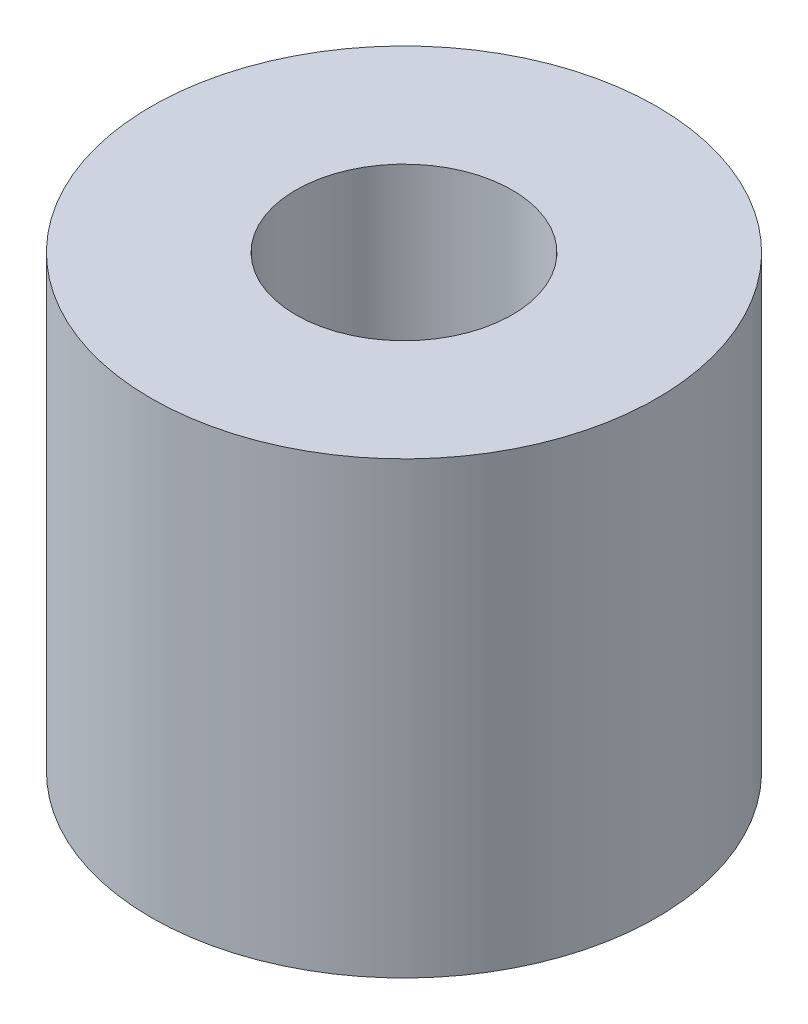
ISO-10303-21;
HEADER;
FILE_DESCRIPTION(('STEP AP214'),'2;1');
FILE_NAME('part.step','',(''),(''),'','','');
FILE_SCHEMA(('AUTOMOTIVE_DESIGN { 1 0 10303 214 1 1 1 1 }'));
ENDSEC;
DATA;
#1=APPLICATION_CONTEXT('core data for automotive mechanical design processes');
#2=APPLICATION_PROTOCOL_DEFINITION('international standard','automotive_design',2000,#1);
#3=PRODUCT_CONTEXT('',#1,'mechanical');
#4=PRODUCT('Part','Part','',(#3));
#5=PRODUCT_RELATED_PRODUCT_CATEGORY('part','',(#4));
#6=PRODUCT_DEFINITION_FORMATION('','',#4);
#7=PRODUCT_DEFINITION_CONTEXT('part definition',#1,'design');
#8=PRODUCT_DEFINITION('design','',#6,#7);
#9=PRODUCT_DEFINITION_SHAPE('','',#8);
#10=(LENGTH_UNIT() NAMED_UNIT(*) SI_UNIT(.MILLI.,.METRE.));
#11=(NAMED_UNIT(*) PLANE_ANGLE_UNIT() SI_UNIT($,.RADIAN.));
#12=(NAMED_UNIT(*) SI_UNIT($,.STERADIAN.) SOLID_ANGLE_UNIT());
#13=UNCERTAINTY_MEASURE_WITH_UNIT(LENGTH_MEASURE(1.E-05),#10,'distance_accuracy_value','');
#14=(GEOMETRIC_REPRESENTATION_CONTEXT(3) GLOBAL_UNCERTAINTY_ASSIGNED_CONTEXT((#13)) GLOBAL_UNIT_ASSIGNED_CONTEXT((#10,
#11,#12)) REPRESENTATION_CONTEXT('',''));
#15=CARTESIAN_POINT('',(0.,0.,0.));
#16=DIRECTION('',(0.,0.,1.));
#17=DIRECTION('',(1.,0.,0.));
#18=AXIS2_PLACEMENT_3D('',#15,#16,#17);
#19=CARTESIAN_POINT('',(0.,88.9,0.));
#20=DIRECTION('',(0.,1.,0.));
#21=DIRECTION('',(0.,0.,1.));
#22=AXIS2_PLACEMENT_3D('',#19,#20,#21);
#23=PLANE('',#22);
#24=CARTESIAN_POINT('',(0.,88.9,0.));
#25=DIRECTION('',(0.,1.,0.));
#26=DIRECTION('',(0.,0.,1.));
#27=AXIS2_PLACEMENT_3D('',#24,#25,#26);
#28=CIRCLE('',#27,50.);
#29=CARTESIAN_POINT('',(0.,88.9,50.));
#30=VERTEX_POINT('',#29);
#31=EDGE_CURVE('E10',#30,#30,#28,.T.);
#32=ORIENTED_EDGE('',*,*,#31,.T.);
#33=EDGE_LOOP('',(#32));
#34=FACE_BOUND('',#33,.T.);
#35=CARTESIAN_POINT('',(0.,88.9,0.));
#36=DIRECTION('',(0.,1.,0.));
#37=DIRECTION('',(0.,0.,1.));
#38=AXIS2_PLACEMENT_3D('',#35,#36,#37);
#39=CIRCLE('',#38,21.39);
#40=CARTESIAN_POINT('',(0.,88.9,21.39));
#41=VERTEX_POINT('',#40);
#42=EDGE_CURVE('E50',#41,#41,#39,.T.);
#43=ORIENTED_EDGE('',*,*,#42,.F.);
#44=EDGE_LOOP('',(#43));
#45=FACE_BOUND('',#44,.T.);
#46=ADVANCED_FACE('F37',(#34,#45),#23,.T.);
#47=CARTESIAN_POINT('',(0.,0.,0.));
#48=DIRECTION('',(0.,1.,0.));
#49=DIRECTION('',(0.,0.,1.));
#50=AXIS2_PLACEMENT_3D('',#47,#48,#49);
#51=PLANE('',#50);
#52=CARTESIAN_POINT('',(0.,0.,0.));
#53=DIRECTION('',(0.,1.,0.));
#54=DIRECTION('',(0.,0.,1.));
#55=AXIS2_PLACEMENT_3D('',#52,#53,#54);
#56=CIRCLE('',#55,50.);
#57=CARTESIAN_POINT('',(0.,0.,50.));
#58=VERTEX_POINT('',#57);
#59=EDGE_CURVE('E41',#58,#58,#56,.T.);
#60=ORIENTED_EDGE('',*,*,#59,.F.);
#61=EDGE_LOOP('',(#60));
#62=FACE_BOUND('',#61,.T.);
#63=CARTESIAN_POINT('',(0.,0.,0.));
#64=DIRECTION('',(0.,1.,0.));
#65=DIRECTION('',(0.,0.,1.));
#66=AXIS2_PLACEMENT_3D('',#63,#64,#65);
#67=CIRCLE('',#66,21.39);
#68=CARTESIAN_POINT('',(0.,0.,21.39));
#69=VERTEX_POINT('',#68);
#70=EDGE_CURVE('E52',#69,#69,#67,.T.);
#71=ORIENTED_EDGE('',*,*,#70,.T.);
#72=EDGE_LOOP('',(#71));
#73=FACE_BOUND('',#72,.T.);
#74=ADVANCED_FACE('F64',(#62,#73),#51,.F.);
#75=CARTESIAN_POINT('',(0.,88.9,0.));
#76=DIRECTION('',(0.,-1.,0.));
#77=DIRECTION('',(0.,0.,-1.));
#78=AXIS2_PLACEMENT_3D('',#75,#76,#77);
#79=CYLINDRICAL_SURFACE('',#78,50.);
#80=ORIENTED_EDGE('',*,*,#31,.F.);
#81=EDGE_LOOP('',(#80));
#82=FACE_BOUND('',#81,.T.);
#83=ORIENTED_EDGE('',*,*,#59,.T.);
#84=EDGE_LOOP('',(#83));
#85=FACE_BOUND('',#84,.T.);
#86=ADVANCED_FACE('F39',(#82,#85),#79,.T.);
#87=CARTESIAN_POINT('',(0.,88.9,0.));
#88=DIRECTION('',(0.,-1.,0.));
#89=DIRECTION('',(0.,0.,-1.));
#90=AXIS2_PLACEMENT_3D('',#87,#88,#89);
#91=CYLINDRICAL_SURFACE('',#90,21.39);
#92=ORIENTED_EDGE('',*,*,#42,.T.);
#93=EDGE_LOOP('',(#92));
#94=FACE_BOUND('',#93,.T.);
#95=ORIENTED_EDGE('',*,*,#70,.F.);
#96=EDGE_LOOP('',(#95));
#97=FACE_BOUND('',#96,.T.);
#98=ADVANCED_FACE('F60',(#94,#97),#91,.F.);
#99=CLOSED_SHELL('',(#46,#74,#86,#98));
#100=MANIFOLD_SOLID_BREP('B2',#99);
#101=ADVANCED_BREP_SHAPE_REPRESENTATION('',(#18,#100),#14);
#102=SHAPE_DEFINITION_REPRESENTATION(#9,#101);
ENDSEC;
END-ISO-10303-21;
